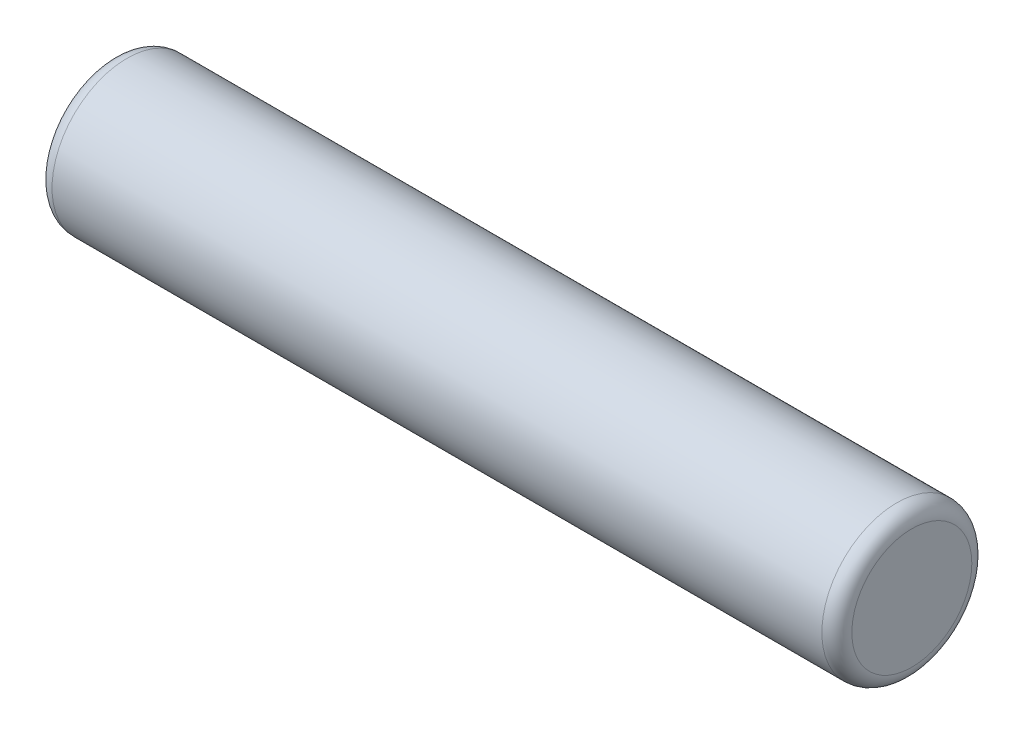
ISO-10303-21;
HEADER;
FILE_DESCRIPTION(('STEP AP214'),'2;1');
FILE_NAME('part.step','',(''),(''),'','','');
FILE_SCHEMA(('AUTOMOTIVE_DESIGN { 1 0 10303 214 1 1 1 1 }'));
ENDSEC;
DATA;
#1=APPLICATION_CONTEXT('core data for automotive mechanical design processes');
#2=APPLICATION_PROTOCOL_DEFINITION('international standard','automotive_design',2000,#1);
#3=PRODUCT_CONTEXT('',#1,'mechanical');
#4=PRODUCT('Part','Part','',(#3));
#5=PRODUCT_RELATED_PRODUCT_CATEGORY('part','',(#4));
#6=PRODUCT_DEFINITION_FORMATION('','',#4);
#7=PRODUCT_DEFINITION_CONTEXT('part definition',#1,'design');
#8=PRODUCT_DEFINITION('design','',#6,#7);
#9=PRODUCT_DEFINITION_SHAPE('','',#8);
#10=(LENGTH_UNIT() NAMED_UNIT(*) SI_UNIT(.MILLI.,.METRE.));
#11=(NAMED_UNIT(*) PLANE_ANGLE_UNIT() SI_UNIT($,.RADIAN.));
#12=(NAMED_UNIT(*) SI_UNIT($,.STERADIAN.) SOLID_ANGLE_UNIT());
#13=UNCERTAINTY_MEASURE_WITH_UNIT(LENGTH_MEASURE(1.E-05),#10,'distance_accuracy_value','');
#14=(GEOMETRIC_REPRESENTATION_CONTEXT(3) GLOBAL_UNCERTAINTY_ASSIGNED_CONTEXT((#13)) GLOBAL_UNIT_ASSIGNED_CONTEXT((#10,
#11,#12)) REPRESENTATION_CONTEXT('',''));
#15=CARTESIAN_POINT('',(0.,0.,0.));
#16=DIRECTION('',(0.,0.,1.));
#17=DIRECTION('',(1.,0.,0.));
#18=AXIS2_PLACEMENT_3D('',#15,#16,#17);
#19=CARTESIAN_POINT('',(0.,0.,0.));
#20=DIRECTION('',(1.,0.,0.));
#21=DIRECTION('',(0.,0.,-1.));
#22=AXIS2_PLACEMENT_3D('',#19,#20,#21);
#23=PLANE('',#22);
#24=CARTESIAN_POINT('',(0.,0.,0.));
#25=DIRECTION('',(1.,0.,0.));
#26=DIRECTION('',(0.,0.,-1.));
#27=AXIS2_PLACEMENT_3D('',#24,#25,#26);
#28=CIRCLE('',#27,1.20000000000006);
#29=CARTESIAN_POINT('',(0.,0.,-1.20000000000006));
#30=VERTEX_POINT('',#29);
#31=EDGE_CURVE('E30',#30,#30,#28,.T.);
#32=ORIENTED_EDGE('',*,*,#31,.F.);
#33=EDGE_LOOP('',(#32));
#34=FACE_BOUND('',#33,.T.);
#35=ADVANCED_FACE('F15',(#34),#23,.F.);
#36=CARTESIAN_POINT('',(0.299999999999939,0.,0.));
#37=DIRECTION('',(1.,0.,0.));
#38=DIRECTION('',(0.,0.,-1.));
#39=AXIS2_PLACEMENT_3D('',#36,#37,#38);
#40=TOROIDAL_SURFACE('',#39,1.20000000000006,0.299999999999939);
#41=ORIENTED_EDGE('',*,*,#31,.T.);
#42=EDGE_LOOP('',(#41));
#43=FACE_BOUND('',#42,.T.);
#44=CARTESIAN_POINT('',(0.300000000000001,0.,0.));
#45=DIRECTION('',(1.,0.,0.));
#46=DIRECTION('',(0.,0.,-1.));
#47=AXIS2_PLACEMENT_3D('',#44,#45,#46);
#48=CIRCLE('',#47,1.5);
#49=CARTESIAN_POINT('',(0.300000000000001,0.,-1.5));
#50=VERTEX_POINT('',#49);
#51=EDGE_CURVE('E26',#50,#50,#48,.T.);
#52=ORIENTED_EDGE('',*,*,#51,.F.);
#53=EDGE_LOOP('',(#52));
#54=FACE_BOUND('',#53,.T.);
#55=ADVANCED_FACE('F36',(#43,#54),#40,.T.);
#56=CARTESIAN_POINT('',(16.,0.,0.));
#57=DIRECTION('',(1.,0.,0.));
#58=DIRECTION('',(0.,0.,-1.));
#59=AXIS2_PLACEMENT_3D('',#56,#57,#58);
#60=CYLINDRICAL_SURFACE('',#59,1.5);
#61=CARTESIAN_POINT('',(15.7,0.,0.));
#62=DIRECTION('',(1.,0.,0.));
#63=DIRECTION('',(0.,0.,-1.));
#64=AXIS2_PLACEMENT_3D('',#61,#62,#63);
#65=CIRCLE('',#64,1.5);
#66=CARTESIAN_POINT('',(15.7,0.,-1.5));
#67=VERTEX_POINT('',#66);
#68=EDGE_CURVE('E22',#67,#67,#65,.T.);
#69=ORIENTED_EDGE('',*,*,#68,.F.);
#70=EDGE_LOOP('',(#69));
#71=FACE_BOUND('',#70,.T.);
#72=ORIENTED_EDGE('',*,*,#51,.T.);
#73=EDGE_LOOP('',(#72));
#74=FACE_BOUND('',#73,.T.);
#75=ADVANCED_FACE('F45',(#71,#74),#60,.T.);
#76=CARTESIAN_POINT('',(15.7,0.,0.));
#77=DIRECTION('',(1.,0.,0.));
#78=DIRECTION('',(0.,0.,-1.));
#79=AXIS2_PLACEMENT_3D('',#76,#77,#78);
#80=TOROIDAL_SURFACE('',#79,1.20000000000012,0.299999999999879);
#81=ORIENTED_EDGE('',*,*,#68,.T.);
#82=EDGE_LOOP('',(#81));
#83=FACE_BOUND('',#82,.T.);
#84=CARTESIAN_POINT('',(16.,0.,0.));
#85=DIRECTION('',(1.,0.,0.));
#86=DIRECTION('',(0.,0.,-1.));
#87=AXIS2_PLACEMENT_3D('',#84,#85,#86);
#88=CIRCLE('',#87,1.20000000000012);
#89=CARTESIAN_POINT('',(16.,0.,-1.20000000000012));
#90=VERTEX_POINT('',#89);
#91=EDGE_CURVE('E10',#90,#90,#88,.T.);
#92=ORIENTED_EDGE('',*,*,#91,.F.);
#93=EDGE_LOOP('',(#92));
#94=FACE_BOUND('',#93,.T.);
#95=ADVANCED_FACE('F49',(#83,#94),#80,.T.);
#96=CARTESIAN_POINT('',(16.,1.2,0.));
#97=DIRECTION('',(-1.,0.,0.));
#98=DIRECTION('',(0.,0.,1.));
#99=AXIS2_PLACEMENT_3D('',#96,#97,#98);
#100=PLANE('',#99);
#101=ORIENTED_EDGE('',*,*,#91,.T.);
#102=EDGE_LOOP('',(#101));
#103=FACE_BOUND('',#102,.T.);
#104=ADVANCED_FACE('F17',(#103),#100,.F.);
#105=CLOSED_SHELL('',(#35,#55,#75,#95,#104));
#106=MANIFOLD_SOLID_BREP('B1',#105);
#107=ADVANCED_BREP_SHAPE_REPRESENTATION('',(#18,#106),#14);
#108=SHAPE_DEFINITION_REPRESENTATION(#9,#107);
ENDSEC;
END-ISO-10303-21;
